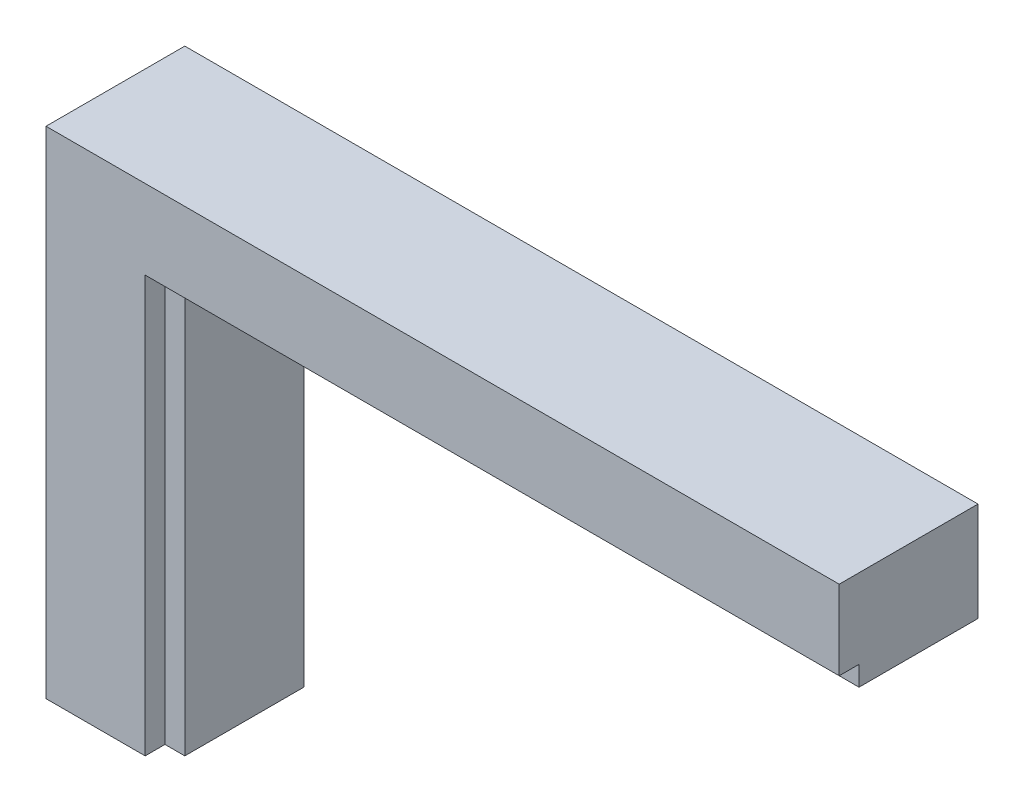
ISO-10303-21;
HEADER;
FILE_DESCRIPTION(('STEP AP214'),'2;1');
FILE_NAME('part.step','',(''),(''),'','','');
FILE_SCHEMA(('AUTOMOTIVE_DESIGN { 1 0 10303 214 1 1 1 1 }'));
ENDSEC;
DATA;
#1=APPLICATION_CONTEXT('core data for automotive mechanical design processes');
#2=APPLICATION_PROTOCOL_DEFINITION('international standard','automotive_design',2000,#1);
#3=PRODUCT_CONTEXT('',#1,'mechanical');
#4=PRODUCT('Part','Part','',(#3));
#5=PRODUCT_RELATED_PRODUCT_CATEGORY('part','',(#4));
#6=PRODUCT_DEFINITION_FORMATION('','',#4);
#7=PRODUCT_DEFINITION_CONTEXT('part definition',#1,'design');
#8=PRODUCT_DEFINITION('design','',#6,#7);
#9=PRODUCT_DEFINITION_SHAPE('','',#8);
#10=(LENGTH_UNIT() NAMED_UNIT(*) SI_UNIT(.MILLI.,.METRE.));
#11=(NAMED_UNIT(*) PLANE_ANGLE_UNIT() SI_UNIT($,.RADIAN.));
#12=(NAMED_UNIT(*) SI_UNIT($,.STERADIAN.) SOLID_ANGLE_UNIT());
#13=UNCERTAINTY_MEASURE_WITH_UNIT(LENGTH_MEASURE(1.E-05),#10,'distance_accuracy_value','');
#14=(GEOMETRIC_REPRESENTATION_CONTEXT(3) GLOBAL_UNCERTAINTY_ASSIGNED_CONTEXT((#13)) GLOBAL_UNIT_ASSIGNED_CONTEXT((#10,
#11,#12)) REPRESENTATION_CONTEXT('',''));
#15=CARTESIAN_POINT('',(0.,0.,0.));
#16=DIRECTION('',(0.,0.,1.));
#17=DIRECTION('',(1.,0.,0.));
#18=AXIS2_PLACEMENT_3D('',#15,#16,#17);
#19=CARTESIAN_POINT('',(60.,0.,70.));
#20=DIRECTION('',(0.,1.,0.));
#21=DIRECTION('',(-1.,0.,0.));
#22=AXIS2_PLACEMENT_3D('',#19,#20,#21);
#23=PLANE('',#22);
#24=DIRECTION('',(0.,0.,-1.));
#25=VECTOR('',#24,1.);
#26=CARTESIAN_POINT('',(60.,0.,70.));
#27=LINE('',#26,#25);
#28=CARTESIAN_POINT('',(60.,0.,60.));
#29=VERTEX_POINT('',#28);
#30=CARTESIAN_POINT('',(60.,0.,0.));
#31=VERTEX_POINT('',#30);
#32=EDGE_CURVE('E11',#29,#31,#27,.T.);
#33=ORIENTED_EDGE('',*,*,#32,.F.);
#34=DIRECTION('',(1.,0.,0.));
#35=VECTOR('',#34,1.);
#36=CARTESIAN_POINT('',(60.,0.,60.));
#37=LINE('',#36,#35);
#38=CARTESIAN_POINT('',(50.,0.,60.));
#39=VERTEX_POINT('',#38);
#40=EDGE_CURVE('E128',#39,#29,#37,.T.);
#41=ORIENTED_EDGE('',*,*,#40,.F.);
#42=DIRECTION('',(0.,0.,-1.));
#43=VECTOR('',#42,1.);
#44=CARTESIAN_POINT('',(50.,0.,70.));
#45=LINE('',#44,#43);
#46=CARTESIAN_POINT('',(50.,0.,70.));
#47=VERTEX_POINT('',#46);
#48=EDGE_CURVE('E121',#47,#39,#45,.T.);
#49=ORIENTED_EDGE('',*,*,#48,.F.);
#50=DIRECTION('',(1.,0.,0.));
#51=VECTOR('',#50,1.);
#52=CARTESIAN_POINT('',(60.,0.,70.));
#53=LINE('',#52,#51);
#54=CARTESIAN_POINT('',(0.,0.,70.));
#55=VERTEX_POINT('',#54);
#56=EDGE_CURVE('E147',#55,#47,#53,.T.);
#57=ORIENTED_EDGE('',*,*,#56,.F.);
#58=DIRECTION('',(0.,0.,-1.));
#59=VECTOR('',#58,1.);
#60=CARTESIAN_POINT('',(0.,0.,70.));
#61=LINE('',#60,#59);
#62=CARTESIAN_POINT('',(0.,0.,0.));
#63=VERTEX_POINT('',#62);
#64=EDGE_CURVE('E144',#55,#63,#61,.T.);
#65=ORIENTED_EDGE('',*,*,#64,.T.);
#66=DIRECTION('',(1.,0.,0.));
#67=VECTOR('',#66,1.);
#68=CARTESIAN_POINT('',(60.,0.,0.));
#69=LINE('',#68,#67);
#70=EDGE_CURVE('E131',#63,#31,#69,.T.);
#71=ORIENTED_EDGE('',*,*,#70,.T.);
#72=EDGE_LOOP('',(#33,#41,#49,#57,#65,#71));
#73=FACE_BOUND('',#72,.T.);
#74=ADVANCED_FACE('F33',(#73),#23,.F.);
#75=CARTESIAN_POINT('',(60.,200.,70.));
#76=DIRECTION('',(-1.,0.,0.));
#77=DIRECTION('',(0.,0.,1.));
#78=AXIS2_PLACEMENT_3D('',#75,#76,#77);
#79=PLANE('',#78);
#80=DIRECTION('',(0.,0.,-1.));
#81=VECTOR('',#80,1.);
#82=CARTESIAN_POINT('',(60.,200.,70.));
#83=LINE('',#82,#81);
#84=CARTESIAN_POINT('',(60.,200.,60.));
#85=VERTEX_POINT('',#84);
#86=CARTESIAN_POINT('',(60.,200.,0.));
#87=VERTEX_POINT('',#86);
#88=EDGE_CURVE('E41',#85,#87,#83,.T.);
#89=ORIENTED_EDGE('',*,*,#88,.F.);
#90=DIRECTION('',(0.,-1.,0.));
#91=VECTOR('',#90,1.);
#92=CARTESIAN_POINT('',(60.,210.,60.));
#93=LINE('',#92,#91);
#94=EDGE_CURVE('E125',#85,#29,#93,.T.);
#95=ORIENTED_EDGE('',*,*,#94,.T.);
#96=ORIENTED_EDGE('',*,*,#32,.T.);
#97=DIRECTION('',(0.,1.,0.));
#98=VECTOR('',#97,1.);
#99=CARTESIAN_POINT('',(60.,200.,0.));
#100=LINE('',#99,#98);
#101=EDGE_CURVE('E136',#31,#87,#100,.T.);
#102=ORIENTED_EDGE('',*,*,#101,.T.);
#103=EDGE_LOOP('',(#89,#95,#96,#102));
#104=FACE_BOUND('',#103,.T.);
#105=ADVANCED_FACE('F134',(#104),#79,.F.);
#106=CARTESIAN_POINT('',(400.,200.,70.));
#107=DIRECTION('',(0.,1.,0.));
#108=DIRECTION('',(-1.,0.,0.));
#109=AXIS2_PLACEMENT_3D('',#106,#107,#108);
#110=PLANE('',#109);
#111=DIRECTION('',(0.,0.,-1.));
#112=VECTOR('',#111,1.);
#113=CARTESIAN_POINT('',(400.,200.,70.));
#114=LINE('',#113,#112);
#115=CARTESIAN_POINT('',(400.,200.,60.));
#116=VERTEX_POINT('',#115);
#117=CARTESIAN_POINT('',(400.,200.,0.));
#118=VERTEX_POINT('',#117);
#119=EDGE_CURVE('E117',#116,#118,#114,.T.);
#120=ORIENTED_EDGE('',*,*,#119,.F.);
#121=DIRECTION('',(1.,0.,0.));
#122=VECTOR('',#121,1.);
#123=CARTESIAN_POINT('',(60.,200.,60.));
#124=LINE('',#123,#122);
#125=EDGE_CURVE('E111',#85,#116,#124,.T.);
#126=ORIENTED_EDGE('',*,*,#125,.F.);
#127=ORIENTED_EDGE('',*,*,#88,.T.);
#128=DIRECTION('',(1.,0.,0.));
#129=VECTOR('',#128,1.);
#130=CARTESIAN_POINT('',(400.,200.,0.));
#131=LINE('',#130,#129);
#132=EDGE_CURVE('E151',#87,#118,#131,.T.);
#133=ORIENTED_EDGE('',*,*,#132,.T.);
#134=EDGE_LOOP('',(#120,#126,#127,#133));
#135=FACE_BOUND('',#134,.T.);
#136=ADVANCED_FACE('F113',(#135),#110,.F.);
#137=CARTESIAN_POINT('',(400.,250.,70.));
#138=DIRECTION('',(-1.,0.,0.));
#139=DIRECTION('',(0.,-1.,0.));
#140=AXIS2_PLACEMENT_3D('',#137,#138,#139);
#141=PLANE('',#140);
#142=DIRECTION('',(0.,1.,0.));
#143=VECTOR('',#142,1.);
#144=CARTESIAN_POINT('',(400.,250.,70.));
#145=LINE('',#144,#143);
#146=CARTESIAN_POINT('',(400.,210.,70.));
#147=VERTEX_POINT('',#146);
#148=CARTESIAN_POINT('',(400.,250.,70.));
#149=VERTEX_POINT('',#148);
#150=EDGE_CURVE('E82',#147,#149,#145,.T.);
#151=ORIENTED_EDGE('',*,*,#150,.F.);
#152=DIRECTION('',(0.,0.,1.));
#153=VECTOR('',#152,1.);
#154=CARTESIAN_POINT('',(400.,210.,70.));
#155=LINE('',#154,#153);
#156=CARTESIAN_POINT('',(400.,210.,60.));
#157=VERTEX_POINT('',#156);
#158=EDGE_CURVE('E122',#157,#147,#155,.T.);
#159=ORIENTED_EDGE('',*,*,#158,.F.);
#160=DIRECTION('',(0.,1.,0.));
#161=VECTOR('',#160,1.);
#162=CARTESIAN_POINT('',(400.,200.,60.));
#163=LINE('',#162,#161);
#164=EDGE_CURVE('E177',#116,#157,#163,.T.);
#165=ORIENTED_EDGE('',*,*,#164,.F.);
#166=ORIENTED_EDGE('',*,*,#119,.T.);
#167=DIRECTION('',(0.,1.,0.));
#168=VECTOR('',#167,1.);
#169=CARTESIAN_POINT('',(400.,250.,0.));
#170=LINE('',#169,#168);
#171=CARTESIAN_POINT('',(400.,250.,0.));
#172=VERTEX_POINT('',#171);
#173=EDGE_CURVE('E149',#118,#172,#170,.T.);
#174=ORIENTED_EDGE('',*,*,#173,.T.);
#175=DIRECTION('',(0.,0.,-1.));
#176=VECTOR('',#175,1.);
#177=CARTESIAN_POINT('',(400.,250.,70.));
#178=LINE('',#177,#176);
#179=EDGE_CURVE('E138',#149,#172,#178,.T.);
#180=ORIENTED_EDGE('',*,*,#179,.F.);
#181=EDGE_LOOP('',(#151,#159,#165,#166,#174,#180));
#182=FACE_BOUND('',#181,.T.);
#183=ADVANCED_FACE('F181',(#182),#141,.F.);
#184=CARTESIAN_POINT('',(0.,250.,70.));
#185=DIRECTION('',(0.,-1.,0.));
#186=DIRECTION('',(0.,0.,-1.));
#187=AXIS2_PLACEMENT_3D('',#184,#185,#186);
#188=PLANE('',#187);
#189=DIRECTION('',(-1.,0.,0.));
#190=VECTOR('',#189,1.);
#191=CARTESIAN_POINT('',(0.,250.,0.));
#192=LINE('',#191,#190);
#193=CARTESIAN_POINT('',(0.,250.,0.));
#194=VERTEX_POINT('',#193);
#195=EDGE_CURVE('E72',#172,#194,#192,.T.);
#196=ORIENTED_EDGE('',*,*,#195,.T.);
#197=DIRECTION('',(0.,0.,-1.));
#198=VECTOR('',#197,1.);
#199=CARTESIAN_POINT('',(0.,250.,70.));
#200=LINE('',#199,#198);
#201=CARTESIAN_POINT('',(0.,250.,70.));
#202=VERTEX_POINT('',#201);
#203=EDGE_CURVE('E142',#202,#194,#200,.T.);
#204=ORIENTED_EDGE('',*,*,#203,.F.);
#205=DIRECTION('',(-1.,0.,0.));
#206=VECTOR('',#205,1.);
#207=CARTESIAN_POINT('',(0.,250.,70.));
#208=LINE('',#207,#206);
#209=EDGE_CURVE('E157',#149,#202,#208,.T.);
#210=ORIENTED_EDGE('',*,*,#209,.F.);
#211=ORIENTED_EDGE('',*,*,#179,.T.);
#212=EDGE_LOOP('',(#196,#204,#210,#211));
#213=FACE_BOUND('',#212,.T.);
#214=ADVANCED_FACE('F195',(#213),#188,.F.);
#215=CARTESIAN_POINT('',(0.,0.,70.));
#216=DIRECTION('',(1.,0.,0.));
#217=DIRECTION('',(0.,0.,-1.));
#218=AXIS2_PLACEMENT_3D('',#215,#216,#217);
#219=PLANE('',#218);
#220=DIRECTION('',(0.,-1.,0.));
#221=VECTOR('',#220,1.);
#222=CARTESIAN_POINT('',(0.,0.,0.));
#223=LINE('',#222,#221);
#224=EDGE_CURVE('E77',#194,#63,#223,.T.);
#225=ORIENTED_EDGE('',*,*,#224,.T.);
#226=ORIENTED_EDGE('',*,*,#64,.F.);
#227=DIRECTION('',(0.,-1.,0.));
#228=VECTOR('',#227,1.);
#229=CARTESIAN_POINT('',(0.,0.,70.));
#230=LINE('',#229,#228);
#231=EDGE_CURVE('E49',#202,#55,#230,.T.);
#232=ORIENTED_EDGE('',*,*,#231,.F.);
#233=ORIENTED_EDGE('',*,*,#203,.T.);
#234=EDGE_LOOP('',(#225,#226,#232,#233));
#235=FACE_BOUND('',#234,.T.);
#236=ADVANCED_FACE('F198',(#235),#219,.F.);
#237=CARTESIAN_POINT('',(0.,0.,70.));
#238=DIRECTION('',(0.,0.,-1.));
#239=DIRECTION('',(-1.,0.,0.));
#240=AXIS2_PLACEMENT_3D('',#237,#238,#239);
#241=PLANE('',#240);
#242=DIRECTION('',(-1.,0.,0.));
#243=VECTOR('',#242,1.);
#244=CARTESIAN_POINT('',(60.,210.,70.));
#245=LINE('',#244,#243);
#246=CARTESIAN_POINT('',(50.,210.,70.));
#247=VERTEX_POINT('',#246);
#248=EDGE_CURVE('E166',#147,#247,#245,.T.);
#249=ORIENTED_EDGE('',*,*,#248,.F.);
#250=ORIENTED_EDGE('',*,*,#150,.T.);
#251=ORIENTED_EDGE('',*,*,#209,.T.);
#252=ORIENTED_EDGE('',*,*,#231,.T.);
#253=ORIENTED_EDGE('',*,*,#56,.T.);
#254=DIRECTION('',(0.,-1.,0.));
#255=VECTOR('',#254,1.);
#256=CARTESIAN_POINT('',(50.,210.,70.));
#257=LINE('',#256,#255);
#258=EDGE_CURVE('E161',#247,#47,#257,.T.);
#259=ORIENTED_EDGE('',*,*,#258,.F.);
#260=EDGE_LOOP('',(#249,#250,#251,#252,#253,#259));
#261=FACE_BOUND('',#260,.T.);
#262=ADVANCED_FACE('F196',(#261),#241,.F.);
#263=CARTESIAN_POINT('',(0.,0.,0.));
#264=DIRECTION('',(0.,0.,-1.));
#265=DIRECTION('',(-1.,0.,0.));
#266=AXIS2_PLACEMENT_3D('',#263,#264,#265);
#267=PLANE('',#266);
#268=ORIENTED_EDGE('',*,*,#70,.F.);
#269=ORIENTED_EDGE('',*,*,#224,.F.);
#270=ORIENTED_EDGE('',*,*,#195,.F.);
#271=ORIENTED_EDGE('',*,*,#173,.F.);
#272=ORIENTED_EDGE('',*,*,#132,.F.);
#273=ORIENTED_EDGE('',*,*,#101,.F.);
#274=EDGE_LOOP('',(#268,#269,#270,#271,#272,#273));
#275=FACE_BOUND('',#274,.T.);
#276=ADVANCED_FACE('F192',(#275),#267,.T.);
#277=CARTESIAN_POINT('',(60.,210.,60.));
#278=DIRECTION('',(0.,0.,-1.));
#279=DIRECTION('',(-1.,0.,0.));
#280=AXIS2_PLACEMENT_3D('',#277,#278,#279);
#281=PLANE('',#280);
#282=ORIENTED_EDGE('',*,*,#40,.T.);
#283=ORIENTED_EDGE('',*,*,#94,.F.);
#284=ORIENTED_EDGE('',*,*,#125,.T.);
#285=ORIENTED_EDGE('',*,*,#164,.T.);
#286=DIRECTION('',(1.,0.,0.));
#287=VECTOR('',#286,1.);
#288=CARTESIAN_POINT('',(60.,210.,60.));
#289=LINE('',#288,#287);
#290=CARTESIAN_POINT('',(50.,210.,60.));
#291=VERTEX_POINT('',#290);
#292=EDGE_CURVE('E163',#291,#157,#289,.T.);
#293=ORIENTED_EDGE('',*,*,#292,.F.);
#294=DIRECTION('',(0.,-1.,0.));
#295=VECTOR('',#294,1.);
#296=CARTESIAN_POINT('',(50.,210.,60.));
#297=LINE('',#296,#295);
#298=EDGE_CURVE('E132',#291,#39,#297,.T.);
#299=ORIENTED_EDGE('',*,*,#298,.T.);
#300=EDGE_LOOP('',(#282,#283,#284,#285,#293,#299));
#301=FACE_BOUND('',#300,.T.);
#302=ADVANCED_FACE('F126',(#301),#281,.F.);
#303=CARTESIAN_POINT('',(50.,210.,70.));
#304=DIRECTION('',(-1.,0.,0.));
#305=DIRECTION('',(0.,-1.,0.));
#306=AXIS2_PLACEMENT_3D('',#303,#304,#305);
#307=PLANE('',#306);
#308=ORIENTED_EDGE('',*,*,#48,.T.);
#309=ORIENTED_EDGE('',*,*,#298,.F.);
#310=DIRECTION('',(0.,0.,-1.));
#311=VECTOR('',#310,1.);
#312=CARTESIAN_POINT('',(50.,210.,70.));
#313=LINE('',#312,#311);
#314=EDGE_CURVE('E170',#247,#291,#313,.T.);
#315=ORIENTED_EDGE('',*,*,#314,.F.);
#316=ORIENTED_EDGE('',*,*,#258,.T.);
#317=EDGE_LOOP('',(#308,#309,#315,#316));
#318=FACE_BOUND('',#317,.T.);
#319=ADVANCED_FACE('F186',(#318),#307,.F.);
#320=CARTESIAN_POINT('',(0.,210.,0.));
#321=DIRECTION('',(0.,1.,0.));
#322=DIRECTION('',(-1.,0.,0.));
#323=AXIS2_PLACEMENT_3D('',#320,#321,#322);
#324=PLANE('',#323);
#325=ORIENTED_EDGE('',*,*,#292,.T.);
#326=ORIENTED_EDGE('',*,*,#158,.T.);
#327=ORIENTED_EDGE('',*,*,#248,.T.);
#328=ORIENTED_EDGE('',*,*,#314,.T.);
#329=EDGE_LOOP('',(#325,#326,#327,#328));
#330=FACE_BOUND('',#329,.T.);
#331=ADVANCED_FACE('F183',(#330),#324,.F.);
#332=CLOSED_SHELL('',(#74,#105,#136,#183,#214,#236,#262,#276,#302,#319,#331));
#333=MANIFOLD_SOLID_BREP('B2',#332);
#334=ADVANCED_BREP_SHAPE_REPRESENTATION('',(#18,#333),#14);
#335=SHAPE_DEFINITION_REPRESENTATION(#9,#334);
ENDSEC;
END-ISO-10303-21;
